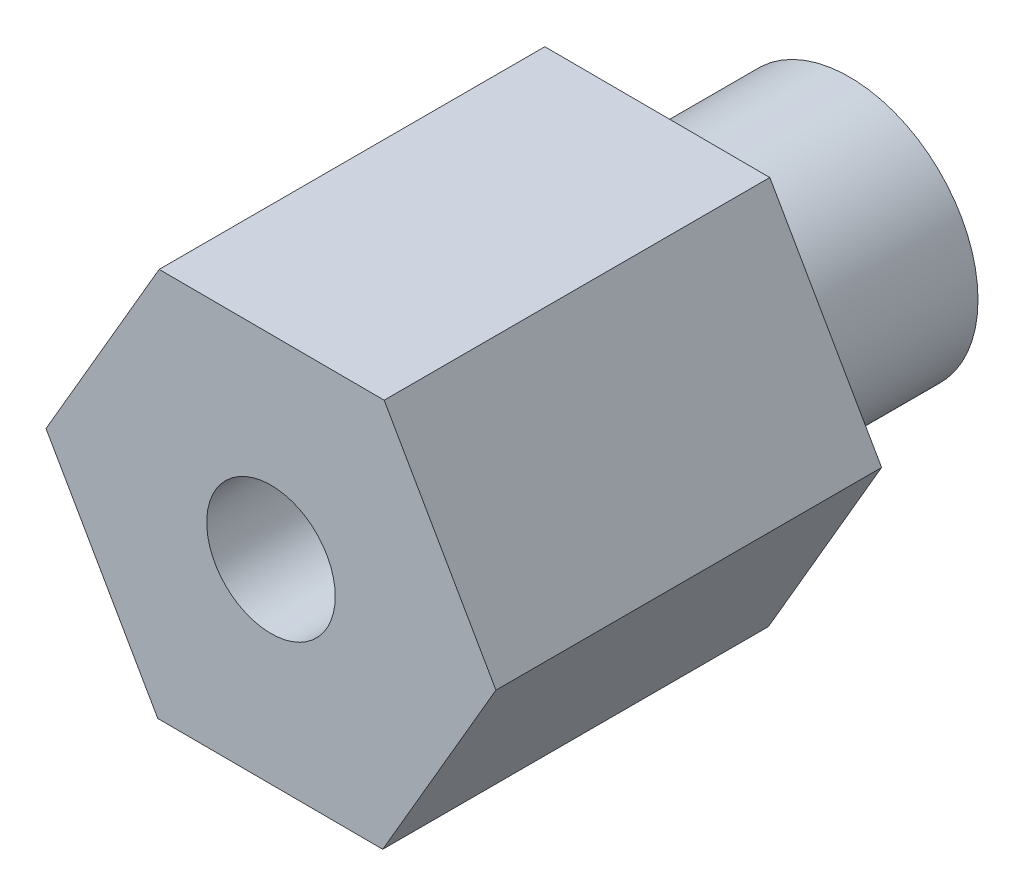
ISO-10303-21;
HEADER;
FILE_DESCRIPTION(('STEP AP214'),'2;1');
FILE_NAME('part.step','',(''),(''),'','','');
FILE_SCHEMA(('AUTOMOTIVE_DESIGN { 1 0 10303 214 1 1 1 1 }'));
ENDSEC;
DATA;
#1=APPLICATION_CONTEXT('core data for automotive mechanical design processes');
#2=APPLICATION_PROTOCOL_DEFINITION('international standard','automotive_design',2000,#1);
#3=PRODUCT_CONTEXT('',#1,'mechanical');
#4=PRODUCT('Part','Part','',(#3));
#5=PRODUCT_RELATED_PRODUCT_CATEGORY('part','',(#4));
#6=PRODUCT_DEFINITION_FORMATION('','',#4);
#7=PRODUCT_DEFINITION_CONTEXT('part definition',#1,'design');
#8=PRODUCT_DEFINITION('design','',#6,#7);
#9=PRODUCT_DEFINITION_SHAPE('','',#8);
#10=(LENGTH_UNIT() NAMED_UNIT(*) SI_UNIT(.MILLI.,.METRE.));
#11=(NAMED_UNIT(*) PLANE_ANGLE_UNIT() SI_UNIT($,.RADIAN.));
#12=(NAMED_UNIT(*) SI_UNIT($,.STERADIAN.) SOLID_ANGLE_UNIT());
#13=UNCERTAINTY_MEASURE_WITH_UNIT(LENGTH_MEASURE(1.E-05),#10,'distance_accuracy_value','');
#14=(GEOMETRIC_REPRESENTATION_CONTEXT(3) GLOBAL_UNCERTAINTY_ASSIGNED_CONTEXT((#13)) GLOBAL_UNIT_ASSIGNED_CONTEXT((#10,
#11,#12)) REPRESENTATION_CONTEXT('',''));
#15=CARTESIAN_POINT('',(0.,0.,0.));
#16=DIRECTION('',(0.,0.,1.));
#17=DIRECTION('',(1.,0.,0.));
#18=AXIS2_PLACEMENT_3D('',#15,#16,#17);
#19=CARTESIAN_POINT('',(0.,0.,3.));
#20=DIRECTION('',(0.,0.,-1.));
#21=DIRECTION('',(-1.,0.,0.));
#22=AXIS2_PLACEMENT_3D('',#19,#20,#21);
#23=CYLINDRICAL_SURFACE('',#22,2.);
#24=CARTESIAN_POINT('',(0.,0.,3.));
#25=DIRECTION('',(0.,0.,1.));
#26=DIRECTION('',(1.,0.,0.));
#27=AXIS2_PLACEMENT_3D('',#24,#25,#26);
#28=CIRCLE('',#27,2.);
#29=CARTESIAN_POINT('',(2.,0.,3.));
#30=VERTEX_POINT('',#29);
#31=EDGE_CURVE('E11',#30,#30,#28,.T.);
#32=ORIENTED_EDGE('',*,*,#31,.F.);
#33=EDGE_LOOP('',(#32));
#34=FACE_BOUND('',#33,.T.);
#35=CARTESIAN_POINT('',(0.,0.,0.));
#36=DIRECTION('',(0.,0.,1.));
#37=DIRECTION('',(1.,0.,0.));
#38=AXIS2_PLACEMENT_3D('',#35,#36,#37);
#39=CIRCLE('',#38,2.);
#40=CARTESIAN_POINT('',(2.,0.,0.));
#41=VERTEX_POINT('',#40);
#42=EDGE_CURVE('E35',#41,#41,#39,.T.);
#43=ORIENTED_EDGE('',*,*,#42,.T.);
#44=EDGE_LOOP('',(#43));
#45=FACE_BOUND('',#44,.T.);
#46=ADVANCED_FACE('F32',(#34,#45),#23,.T.);
#47=CARTESIAN_POINT('',(0.,0.,0.));
#48=DIRECTION('',(0.,0.,1.));
#49=DIRECTION('',(1.,0.,0.));
#50=AXIS2_PLACEMENT_3D('',#47,#48,#49);
#51=PLANE('',#50);
#52=CARTESIAN_POINT('',(0.,0.,0.));
#53=DIRECTION('',(0.,0.,1.));
#54=DIRECTION('',(1.,0.,0.));
#55=AXIS2_PLACEMENT_3D('',#52,#53,#54);
#56=CIRCLE('',#55,1.);
#57=CARTESIAN_POINT('',(1.,0.,0.));
#58=VERTEX_POINT('',#57);
#59=EDGE_CURVE('E121',#58,#58,#56,.T.);
#60=ORIENTED_EDGE('',*,*,#59,.T.);
#61=EDGE_LOOP('',(#60));
#62=FACE_BOUND('',#61,.T.);
#63=ORIENTED_EDGE('',*,*,#42,.F.);
#64=EDGE_LOOP('',(#63));
#65=FACE_BOUND('',#64,.T.);
#66=ADVANCED_FACE('F141',(#62,#65),#51,.F.);
#67=CARTESIAN_POINT('',(1.76087754494395,3.02478268173303,3.));
#68=DIRECTION('',(0.,0.,1.));
#69=DIRECTION('',(1.,0.,0.));
#70=AXIS2_PLACEMENT_3D('',#67,#68,#69);
#71=PLANE('',#70);
#72=DIRECTION('',(-0.496885677381732,0.86781600792616,0.));
#73=VECTOR('',#72,1.);
#74=CARTESIAN_POINT('',(3.49997741578,-0.0125733460085145,3.));
#75=LINE('',#74,#73);
#76=CARTESIAN_POINT('',(3.49997741578,-0.0125733460085145,3.));
#77=VERTEX_POINT('',#76);
#78=CARTESIAN_POINT('',(1.76087754494395,3.02478268173303,3.));
#79=VERTEX_POINT('',#78);
#80=EDGE_CURVE('E117',#77,#79,#75,.T.);
#81=ORIENTED_EDGE('',*,*,#80,.F.);
#82=DIRECTION('',(0.503107869983986,0.864223623352299,0.));
#83=VECTOR('',#82,1.);
#84=CARTESIAN_POINT('',(1.73909987083605,-3.03735602774155,3.));
#85=LINE('',#84,#83);
#86=CARTESIAN_POINT('',(1.73909987083605,-3.03735602774155,3.));
#87=VERTEX_POINT('',#86);
#88=EDGE_CURVE('E77',#87,#77,#85,.T.);
#89=ORIENTED_EDGE('',*,*,#88,.F.);
#90=DIRECTION('',(0.999993547365718,-0.00359238457386166,0.));
#91=VECTOR('',#90,1.);
#92=CARTESIAN_POINT('',(-1.76087754494395,-3.02478268173303,3.));
#93=LINE('',#92,#91);
#94=CARTESIAN_POINT('',(-1.76087754494395,-3.02478268173303,3.));
#95=VERTEX_POINT('',#94);
#96=EDGE_CURVE('E71',#95,#87,#93,.T.);
#97=ORIENTED_EDGE('',*,*,#96,.F.);
#98=DIRECTION('',(0.496885677381732,-0.86781600792616,0.));
#99=VECTOR('',#98,1.);
#100=CARTESIAN_POINT('',(-3.49997741578,0.012573346008514,3.));
#101=LINE('',#100,#99);
#102=CARTESIAN_POINT('',(-3.49997741578,0.012573346008514,3.));
#103=VERTEX_POINT('',#102);
#104=EDGE_CURVE('E107',#103,#95,#101,.T.);
#105=ORIENTED_EDGE('',*,*,#104,.F.);
#106=DIRECTION('',(-0.503107869983986,-0.864223623352299,0.));
#107=VECTOR('',#106,1.);
#108=CARTESIAN_POINT('',(-1.73909987083606,3.03735602774155,3.));
#109=LINE('',#108,#107);
#110=CARTESIAN_POINT('',(-1.73909987083606,3.03735602774155,3.));
#111=VERTEX_POINT('',#110);
#112=EDGE_CURVE('E123',#111,#103,#109,.T.);
#113=ORIENTED_EDGE('',*,*,#112,.F.);
#114=DIRECTION('',(-0.999993547365718,0.00359238457386166,0.));
#115=VECTOR('',#114,1.);
#116=CARTESIAN_POINT('',(1.76087754494395,3.02478268173303,3.));
#117=LINE('',#116,#115);
#118=EDGE_CURVE('E120',#79,#111,#117,.T.);
#119=ORIENTED_EDGE('',*,*,#118,.F.);
#120=EDGE_LOOP('',(#81,#89,#97,#105,#113,#119));
#121=FACE_BOUND('',#120,.T.);
#122=ORIENTED_EDGE('',*,*,#31,.T.);
#123=EDGE_LOOP('',(#122));
#124=FACE_BOUND('',#123,.T.);
#125=ADVANCED_FACE('F143',(#121,#124),#71,.F.);
#126=CARTESIAN_POINT('',(3.49997741578,-0.0125733460085145,9.));
#127=DIRECTION('',(-0.86781600792616,-0.496885677381732,0.));
#128=DIRECTION('',(0.496885677381732,-0.86781600792616,0.));
#129=AXIS2_PLACEMENT_3D('',#126,#127,#128);
#130=PLANE('',#129);
#131=ORIENTED_EDGE('',*,*,#80,.T.);
#132=DIRECTION('',(0.,0.,-1.));
#133=VECTOR('',#132,1.);
#134=CARTESIAN_POINT('',(1.76087754494395,3.02478268173303,9.));
#135=LINE('',#134,#133);
#136=CARTESIAN_POINT('',(1.76087754494395,3.02478268173303,9.));
#137=VERTEX_POINT('',#136);
#138=EDGE_CURVE('E135',#137,#79,#135,.T.);
#139=ORIENTED_EDGE('',*,*,#138,.F.);
#140=DIRECTION('',(-0.496885677381732,0.86781600792616,0.));
#141=VECTOR('',#140,1.);
#142=CARTESIAN_POINT('',(3.49997741578,-0.0125733460085145,9.));
#143=LINE('',#142,#141);
#144=CARTESIAN_POINT('',(3.49997741578,-0.0125733460085145,9.));
#145=VERTEX_POINT('',#144);
#146=EDGE_CURVE('E128',#145,#137,#143,.T.);
#147=ORIENTED_EDGE('',*,*,#146,.F.);
#148=DIRECTION('',(0.,0.,-1.));
#149=VECTOR('',#148,1.);
#150=CARTESIAN_POINT('',(3.49997741578,-0.0125733460085145,9.));
#151=LINE('',#150,#149);
#152=EDGE_CURVE('E113',#145,#77,#151,.T.);
#153=ORIENTED_EDGE('',*,*,#152,.T.);
#154=EDGE_LOOP('',(#131,#139,#147,#153));
#155=FACE_BOUND('',#154,.T.);
#156=ADVANCED_FACE('F149',(#155),#130,.F.);
#157=CARTESIAN_POINT('',(1.76087754494395,3.02478268173303,9.));
#158=DIRECTION('',(-0.00359238457386166,-0.999993547365719,0.));
#159=DIRECTION('',(0.999993547365719,-0.00359238457386166,0.));
#160=AXIS2_PLACEMENT_3D('',#157,#158,#159);
#161=PLANE('',#160);
#162=ORIENTED_EDGE('',*,*,#118,.T.);
#163=DIRECTION('',(0.,0.,-1.));
#164=VECTOR('',#163,1.);
#165=CARTESIAN_POINT('',(-1.73909987083606,3.03735602774155,9.));
#166=LINE('',#165,#164);
#167=CARTESIAN_POINT('',(-1.73909987083606,3.03735602774155,9.));
#168=VERTEX_POINT('',#167);
#169=EDGE_CURVE('E132',#168,#111,#166,.T.);
#170=ORIENTED_EDGE('',*,*,#169,.F.);
#171=DIRECTION('',(-0.999993547365718,0.00359238457386166,0.));
#172=VECTOR('',#171,1.);
#173=CARTESIAN_POINT('',(1.76087754494395,3.02478268173303,9.));
#174=LINE('',#173,#172);
#175=EDGE_CURVE('E86',#137,#168,#174,.T.);
#176=ORIENTED_EDGE('',*,*,#175,.F.);
#177=ORIENTED_EDGE('',*,*,#138,.T.);
#178=EDGE_LOOP('',(#162,#170,#176,#177));
#179=FACE_BOUND('',#178,.T.);
#180=ADVANCED_FACE('F157',(#179),#161,.F.);
#181=CARTESIAN_POINT('',(-1.73909987083606,3.03735602774155,9.));
#182=DIRECTION('',(0.864223623352299,-0.503107869983986,0.));
#183=DIRECTION('',(0.503107869983986,0.864223623352299,0.));
#184=AXIS2_PLACEMENT_3D('',#181,#182,#183);
#185=PLANE('',#184);
#186=ORIENTED_EDGE('',*,*,#112,.T.);
#187=DIRECTION('',(0.,0.,-1.));
#188=VECTOR('',#187,1.);
#189=CARTESIAN_POINT('',(-3.49997741578,0.012573346008514,9.));
#190=LINE('',#189,#188);
#191=CARTESIAN_POINT('',(-3.49997741578,0.012573346008514,9.));
#192=VERTEX_POINT('',#191);
#193=EDGE_CURVE('E108',#192,#103,#190,.T.);
#194=ORIENTED_EDGE('',*,*,#193,.F.);
#195=DIRECTION('',(-0.503107869983986,-0.864223623352299,0.));
#196=VECTOR('',#195,1.);
#197=CARTESIAN_POINT('',(-1.73909987083606,3.03735602774155,9.));
#198=LINE('',#197,#196);
#199=EDGE_CURVE('E99',#168,#192,#198,.T.);
#200=ORIENTED_EDGE('',*,*,#199,.F.);
#201=ORIENTED_EDGE('',*,*,#169,.T.);
#202=EDGE_LOOP('',(#186,#194,#200,#201));
#203=FACE_BOUND('',#202,.T.);
#204=ADVANCED_FACE('F161',(#203),#185,.F.);
#205=CARTESIAN_POINT('',(-3.49997741578,0.012573346008514,9.));
#206=DIRECTION('',(0.86781600792616,0.496885677381732,0.));
#207=DIRECTION('',(-0.496885677381732,0.86781600792616,0.));
#208=AXIS2_PLACEMENT_3D('',#205,#206,#207);
#209=PLANE('',#208);
#210=ORIENTED_EDGE('',*,*,#104,.T.);
#211=DIRECTION('',(0.,0.,-1.));
#212=VECTOR('',#211,1.);
#213=CARTESIAN_POINT('',(-1.76087754494395,-3.02478268173303,9.));
#214=LINE('',#213,#212);
#215=CARTESIAN_POINT('',(-1.76087754494395,-3.02478268173303,9.));
#216=VERTEX_POINT('',#215);
#217=EDGE_CURVE('E104',#216,#95,#214,.T.);
#218=ORIENTED_EDGE('',*,*,#217,.F.);
#219=DIRECTION('',(0.496885677381732,-0.86781600792616,0.));
#220=VECTOR('',#219,1.);
#221=CARTESIAN_POINT('',(-3.49997741578,0.012573346008514,9.));
#222=LINE('',#221,#220);
#223=EDGE_CURVE('E93',#192,#216,#222,.T.);
#224=ORIENTED_EDGE('',*,*,#223,.F.);
#225=ORIENTED_EDGE('',*,*,#193,.T.);
#226=EDGE_LOOP('',(#210,#218,#224,#225));
#227=FACE_BOUND('',#226,.T.);
#228=ADVANCED_FACE('F105',(#227),#209,.F.);
#229=CARTESIAN_POINT('',(-1.76087754494395,-3.02478268173303,9.));
#230=DIRECTION('',(0.00359238457386166,0.999993547365718,0.));
#231=DIRECTION('',(-0.999993547365719,0.00359238457386166,0.));
#232=AXIS2_PLACEMENT_3D('',#229,#230,#231);
#233=PLANE('',#232);
#234=ORIENTED_EDGE('',*,*,#96,.T.);
#235=DIRECTION('',(0.,0.,-1.));
#236=VECTOR('',#235,1.);
#237=CARTESIAN_POINT('',(1.73909987083605,-3.03735602774155,9.));
#238=LINE('',#237,#236);
#239=CARTESIAN_POINT('',(1.73909987083605,-3.03735602774155,9.));
#240=VERTEX_POINT('',#239);
#241=EDGE_CURVE('E109',#240,#87,#238,.T.);
#242=ORIENTED_EDGE('',*,*,#241,.F.);
#243=DIRECTION('',(0.999993547365718,-0.00359238457386166,0.));
#244=VECTOR('',#243,1.);
#245=CARTESIAN_POINT('',(-1.76087754494395,-3.02478268173303,9.));
#246=LINE('',#245,#244);
#247=EDGE_CURVE('E97',#216,#240,#246,.T.);
#248=ORIENTED_EDGE('',*,*,#247,.F.);
#249=ORIENTED_EDGE('',*,*,#217,.T.);
#250=EDGE_LOOP('',(#234,#242,#248,#249));
#251=FACE_BOUND('',#250,.T.);
#252=ADVANCED_FACE('F111',(#251),#233,.F.);
#253=CARTESIAN_POINT('',(1.73909987083605,-3.03735602774155,9.));
#254=DIRECTION('',(-0.864223623352299,0.503107869983986,0.));
#255=DIRECTION('',(-0.503107869983986,-0.864223623352299,0.));
#256=AXIS2_PLACEMENT_3D('',#253,#254,#255);
#257=PLANE('',#256);
#258=ORIENTED_EDGE('',*,*,#88,.T.);
#259=ORIENTED_EDGE('',*,*,#152,.F.);
#260=DIRECTION('',(0.503107869983986,0.864223623352299,0.));
#261=VECTOR('',#260,1.);
#262=CARTESIAN_POINT('',(1.73909987083605,-3.03735602774155,9.));
#263=LINE('',#262,#261);
#264=EDGE_CURVE('E48',#240,#145,#263,.T.);
#265=ORIENTED_EDGE('',*,*,#264,.F.);
#266=ORIENTED_EDGE('',*,*,#241,.T.);
#267=EDGE_LOOP('',(#258,#259,#265,#266));
#268=FACE_BOUND('',#267,.T.);
#269=ADVANCED_FACE('F169',(#268),#257,.F.);
#270=CARTESIAN_POINT('',(1.76087754494395,3.02478268173303,9.));
#271=DIRECTION('',(0.,0.,1.));
#272=DIRECTION('',(1.,0.,0.));
#273=AXIS2_PLACEMENT_3D('',#270,#271,#272);
#274=PLANE('',#273);
#275=CARTESIAN_POINT('',(0.,0.,9.));
#276=DIRECTION('',(0.,0.,1.));
#277=DIRECTION('',(1.,0.,0.));
#278=AXIS2_PLACEMENT_3D('',#275,#276,#277);
#279=CIRCLE('',#278,1.);
#280=CARTESIAN_POINT('',(1.,0.,9.));
#281=VERTEX_POINT('',#280);
#282=EDGE_CURVE('E183',#281,#281,#279,.T.);
#283=ORIENTED_EDGE('',*,*,#282,.F.);
#284=EDGE_LOOP('',(#283));
#285=FACE_BOUND('',#284,.T.);
#286=ORIENTED_EDGE('',*,*,#146,.T.);
#287=ORIENTED_EDGE('',*,*,#175,.T.);
#288=ORIENTED_EDGE('',*,*,#199,.T.);
#289=ORIENTED_EDGE('',*,*,#223,.T.);
#290=ORIENTED_EDGE('',*,*,#247,.T.);
#291=ORIENTED_EDGE('',*,*,#264,.T.);
#292=EDGE_LOOP('',(#286,#287,#288,#289,#290,#291));
#293=FACE_BOUND('',#292,.T.);
#294=ADVANCED_FACE('F95',(#285,#293),#274,.T.);
#295=CARTESIAN_POINT('',(0.,0.,-1.));
#296=DIRECTION('',(0.,0.,1.));
#297=DIRECTION('',(1.,0.,0.));
#298=AXIS2_PLACEMENT_3D('',#295,#296,#297);
#299=CYLINDRICAL_SURFACE('',#298,1.);
#300=ORIENTED_EDGE('',*,*,#282,.T.);
#301=EDGE_LOOP('',(#300));
#302=FACE_BOUND('',#301,.T.);
#303=ORIENTED_EDGE('',*,*,#59,.F.);
#304=EDGE_LOOP('',(#303));
#305=FACE_BOUND('',#304,.T.);
#306=ADVANCED_FACE('F174',(#302,#305),#299,.F.);
#307=CLOSED_SHELL('',(#46,#66,#125,#156,#180,#204,#228,#252,#269,#294,#306));
#308=MANIFOLD_SOLID_BREP('B2',#307);
#309=ADVANCED_BREP_SHAPE_REPRESENTATION('',(#18,#308),#14);
#310=SHAPE_DEFINITION_REPRESENTATION(#9,#309);
ENDSEC;
END-ISO-10303-21;
